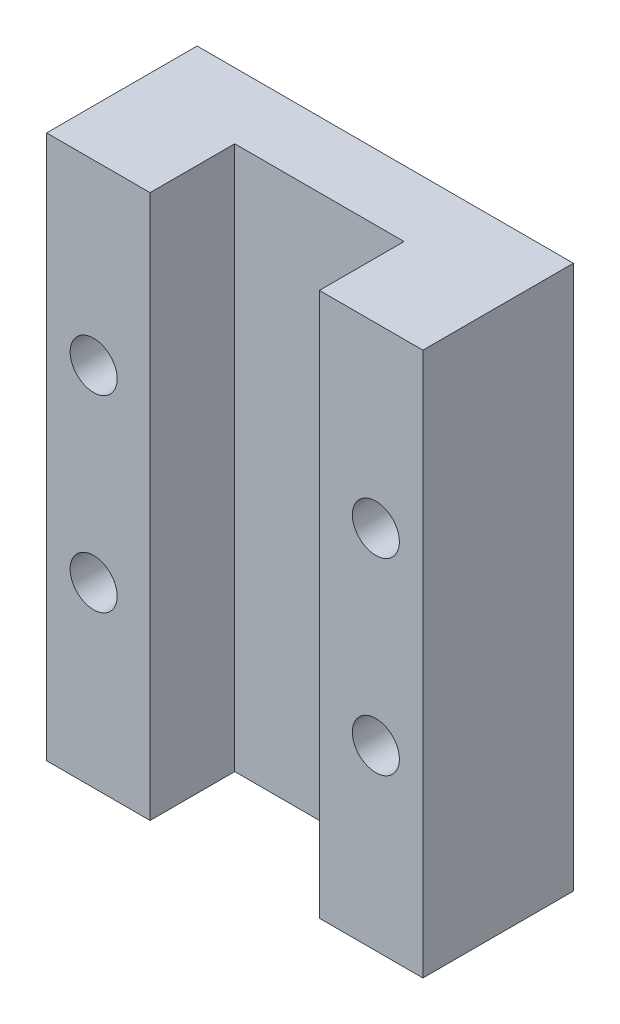
ISO-10303-21;
HEADER;
FILE_DESCRIPTION(('STEP AP214'),'2;1');
FILE_NAME('part.step','',(''),(''),'','','');
FILE_SCHEMA(('AUTOMOTIVE_DESIGN { 1 0 10303 214 1 1 1 1 }'));
ENDSEC;
DATA;
#1=APPLICATION_CONTEXT('core data for automotive mechanical design processes');
#2=APPLICATION_PROTOCOL_DEFINITION('international standard','automotive_design',2000,#1);
#3=PRODUCT_CONTEXT('',#1,'mechanical');
#4=PRODUCT('Part','Part','',(#3));
#5=PRODUCT_RELATED_PRODUCT_CATEGORY('part','',(#4));
#6=PRODUCT_DEFINITION_FORMATION('','',#4);
#7=PRODUCT_DEFINITION_CONTEXT('part definition',#1,'design');
#8=PRODUCT_DEFINITION('design','',#6,#7);
#9=PRODUCT_DEFINITION_SHAPE('','',#8);
#10=(LENGTH_UNIT() NAMED_UNIT(*) SI_UNIT(.MILLI.,.METRE.));
#11=(NAMED_UNIT(*) PLANE_ANGLE_UNIT() SI_UNIT($,.RADIAN.));
#12=(NAMED_UNIT(*) SI_UNIT($,.STERADIAN.) SOLID_ANGLE_UNIT());
#13=UNCERTAINTY_MEASURE_WITH_UNIT(LENGTH_MEASURE(1.E-05),#10,'distance_accuracy_value','');
#14=(GEOMETRIC_REPRESENTATION_CONTEXT(3) GLOBAL_UNCERTAINTY_ASSIGNED_CONTEXT((#13)) GLOBAL_UNIT_ASSIGNED_CONTEXT((#10,
#11,#12)) REPRESENTATION_CONTEXT('',''));
#15=CARTESIAN_POINT('',(0.,0.,0.));
#16=DIRECTION('',(0.,0.,1.));
#17=DIRECTION('',(1.,0.,0.));
#18=AXIS2_PLACEMENT_3D('',#15,#16,#17);
#19=CARTESIAN_POINT('',(0.,0.,8.));
#20=DIRECTION('',(0.,0.,-1.));
#21=DIRECTION('',(-1.,0.,0.));
#22=AXIS2_PLACEMENT_3D('',#19,#20,#21);
#23=PLANE('',#22);
#24=CARTESIAN_POINT('',(2.5,9.45,8.));
#25=DIRECTION('',(0.,0.,-1.));
#26=DIRECTION('',(-1.,0.,0.));
#27=AXIS2_PLACEMENT_3D('',#24,#25,#26);
#28=CIRCLE('',#27,1.25);
#29=CARTESIAN_POINT('',(1.25,9.45,8.));
#30=VERTEX_POINT('',#29);
#31=EDGE_CURVE('E201',#30,#30,#28,.T.);
#32=ORIENTED_EDGE('',*,*,#31,.T.);
#33=EDGE_LOOP('',(#32));
#34=FACE_BOUND('',#33,.T.);
#35=CARTESIAN_POINT('',(2.5,19.45,8.));
#36=DIRECTION('',(0.,0.,-1.));
#37=DIRECTION('',(-1.,0.,0.));
#38=AXIS2_PLACEMENT_3D('',#35,#36,#37);
#39=CIRCLE('',#38,1.25);
#40=CARTESIAN_POINT('',(1.25,19.45,8.));
#41=VERTEX_POINT('',#40);
#42=EDGE_CURVE('E189',#41,#41,#39,.T.);
#43=ORIENTED_EDGE('',*,*,#42,.T.);
#44=EDGE_LOOP('',(#43));
#45=FACE_BOUND('',#44,.T.);
#46=DIRECTION('',(1.,0.,0.));
#47=VECTOR('',#46,1.);
#48=CARTESIAN_POINT('',(0.,0.,8.));
#49=LINE('',#48,#47);
#50=CARTESIAN_POINT('',(0.,0.,8.));
#51=VERTEX_POINT('',#50);
#52=CARTESIAN_POINT('',(5.5,0.,8.));
#53=VERTEX_POINT('',#52);
#54=EDGE_CURVE('E92',#51,#53,#49,.T.);
#55=ORIENTED_EDGE('',*,*,#54,.T.);
#56=DIRECTION('',(0.,1.,0.));
#57=VECTOR('',#56,1.);
#58=CARTESIAN_POINT('',(5.5,0.,8.));
#59=LINE('',#58,#57);
#60=CARTESIAN_POINT('',(5.5,28.9,8.));
#61=VERTEX_POINT('',#60);
#62=EDGE_CURVE('E114',#53,#61,#59,.T.);
#63=ORIENTED_EDGE('',*,*,#62,.T.);
#64=DIRECTION('',(-1.,0.,0.));
#65=VECTOR('',#64,1.);
#66=CARTESIAN_POINT('',(0.,28.9,8.));
#67=LINE('',#66,#65);
#68=CARTESIAN_POINT('',(0.,28.9,8.));
#69=VERTEX_POINT('',#68);
#70=EDGE_CURVE('E63',#61,#69,#67,.T.);
#71=ORIENTED_EDGE('',*,*,#70,.T.);
#72=DIRECTION('',(0.,-1.,0.));
#73=VECTOR('',#72,1.);
#74=CARTESIAN_POINT('',(0.,0.,8.));
#75=LINE('',#74,#73);
#76=EDGE_CURVE('E128',#69,#51,#75,.T.);
#77=ORIENTED_EDGE('',*,*,#76,.T.);
#78=EDGE_LOOP('',(#55,#63,#71,#77));
#79=FACE_BOUND('',#78,.T.);
#80=ADVANCED_FACE('F39',(#34,#45,#79),#23,.F.);
#81=CARTESIAN_POINT('',(0.,0.,8.));
#82=DIRECTION('',(1.,0.,0.));
#83=DIRECTION('',(0.,1.,0.));
#84=AXIS2_PLACEMENT_3D('',#81,#82,#83);
#85=PLANE('',#84);
#86=DIRECTION('',(0.,-1.,0.));
#87=VECTOR('',#86,1.);
#88=CARTESIAN_POINT('',(0.,0.,0.));
#89=LINE('',#88,#87);
#90=CARTESIAN_POINT('',(0.,28.9,0.));
#91=VERTEX_POINT('',#90);
#92=CARTESIAN_POINT('',(0.,0.,0.));
#93=VERTEX_POINT('',#92);
#94=EDGE_CURVE('E140',#91,#93,#89,.T.);
#95=ORIENTED_EDGE('',*,*,#94,.T.);
#96=DIRECTION('',(0.,0.,-1.));
#97=VECTOR('',#96,1.);
#98=CARTESIAN_POINT('',(0.,0.,8.));
#99=LINE('',#98,#97);
#100=EDGE_CURVE('E11',#51,#93,#99,.T.);
#101=ORIENTED_EDGE('',*,*,#100,.F.);
#102=ORIENTED_EDGE('',*,*,#76,.F.);
#103=DIRECTION('',(0.,0.,-1.));
#104=VECTOR('',#103,1.);
#105=CARTESIAN_POINT('',(0.,28.9,8.));
#106=LINE('',#105,#104);
#107=EDGE_CURVE('E139',#69,#91,#106,.T.);
#108=ORIENTED_EDGE('',*,*,#107,.T.);
#109=EDGE_LOOP('',(#95,#101,#102,#108));
#110=FACE_BOUND('',#109,.T.);
#111=ADVANCED_FACE('F41',(#110),#85,.F.);
#112=CARTESIAN_POINT('',(0.,0.,8.));
#113=DIRECTION('',(0.,1.,0.));
#114=DIRECTION('',(0.,0.,1.));
#115=AXIS2_PLACEMENT_3D('',#112,#113,#114);
#116=PLANE('',#115);
#117=DIRECTION('',(-1.,0.,0.));
#118=VECTOR('',#117,1.);
#119=CARTESIAN_POINT('',(5.5,0.,3.5));
#120=LINE('',#119,#118);
#121=CARTESIAN_POINT('',(14.5,0.,3.5));
#122=VERTEX_POINT('',#121);
#123=CARTESIAN_POINT('',(5.5,0.,3.5));
#124=VERTEX_POINT('',#123);
#125=EDGE_CURVE('E121',#122,#124,#120,.T.);
#126=ORIENTED_EDGE('',*,*,#125,.T.);
#127=DIRECTION('',(0.,0.,1.));
#128=VECTOR('',#127,1.);
#129=CARTESIAN_POINT('',(5.5,0.,8.));
#130=LINE('',#129,#128);
#131=EDGE_CURVE('E116',#124,#53,#130,.T.);
#132=ORIENTED_EDGE('',*,*,#131,.T.);
#133=ORIENTED_EDGE('',*,*,#54,.F.);
#134=ORIENTED_EDGE('',*,*,#100,.T.);
#135=DIRECTION('',(1.,0.,0.));
#136=VECTOR('',#135,1.);
#137=CARTESIAN_POINT('',(0.,0.,0.));
#138=LINE('',#137,#136);
#139=CARTESIAN_POINT('',(20.,0.,0.));
#140=VERTEX_POINT('',#139);
#141=EDGE_CURVE('E143',#93,#140,#138,.T.);
#142=ORIENTED_EDGE('',*,*,#141,.T.);
#143=DIRECTION('',(0.,0.,-1.));
#144=VECTOR('',#143,1.);
#145=CARTESIAN_POINT('',(20.,0.,8.));
#146=LINE('',#145,#144);
#147=CARTESIAN_POINT('',(20.,0.,8.));
#148=VERTEX_POINT('',#147);
#149=EDGE_CURVE('E47',#148,#140,#146,.T.);
#150=ORIENTED_EDGE('',*,*,#149,.F.);
#151=CARTESIAN_POINT('',(14.5,0.,8.));
#152=VERTEX_POINT('',#151);
#153=EDGE_CURVE('E131',#152,#148,#49,.T.);
#154=ORIENTED_EDGE('',*,*,#153,.F.);
#155=DIRECTION('',(0.,0.,-1.));
#156=VECTOR('',#155,1.);
#157=CARTESIAN_POINT('',(14.5,0.,8.));
#158=LINE('',#157,#156);
#159=EDGE_CURVE('E54',#152,#122,#158,.T.);
#160=ORIENTED_EDGE('',*,*,#159,.T.);
#161=EDGE_LOOP('',(#126,#132,#133,#134,#142,#150,#154,#160));
#162=FACE_BOUND('',#161,.T.);
#163=ADVANCED_FACE('F123',(#162),#116,.F.);
#164=CARTESIAN_POINT('',(20.,0.,8.));
#165=DIRECTION('',(-1.,0.,0.));
#166=DIRECTION('',(0.,-1.,0.));
#167=AXIS2_PLACEMENT_3D('',#164,#165,#166);
#168=PLANE('',#167);
#169=DIRECTION('',(0.,1.,0.));
#170=VECTOR('',#169,1.);
#171=CARTESIAN_POINT('',(20.,0.,0.));
#172=LINE('',#171,#170);
#173=CARTESIAN_POINT('',(20.,28.9,0.));
#174=VERTEX_POINT('',#173);
#175=EDGE_CURVE('E146',#140,#174,#172,.T.);
#176=ORIENTED_EDGE('',*,*,#175,.T.);
#177=DIRECTION('',(0.,0.,-1.));
#178=VECTOR('',#177,1.);
#179=CARTESIAN_POINT('',(20.,28.9,8.));
#180=LINE('',#179,#178);
#181=CARTESIAN_POINT('',(20.,28.9,8.));
#182=VERTEX_POINT('',#181);
#183=EDGE_CURVE('E150',#182,#174,#180,.T.);
#184=ORIENTED_EDGE('',*,*,#183,.F.);
#185=DIRECTION('',(0.,1.,0.));
#186=VECTOR('',#185,1.);
#187=CARTESIAN_POINT('',(20.,0.,8.));
#188=LINE('',#187,#186);
#189=EDGE_CURVE('E130',#148,#182,#188,.T.);
#190=ORIENTED_EDGE('',*,*,#189,.F.);
#191=ORIENTED_EDGE('',*,*,#149,.T.);
#192=EDGE_LOOP('',(#176,#184,#190,#191));
#193=FACE_BOUND('',#192,.T.);
#194=ADVANCED_FACE('F156',(#193),#168,.F.);
#195=CARTESIAN_POINT('',(0.,28.9,8.));
#196=DIRECTION('',(0.,-1.,0.));
#197=DIRECTION('',(0.,0.,-1.));
#198=AXIS2_PLACEMENT_3D('',#195,#196,#197);
#199=PLANE('',#198);
#200=ORIENTED_EDGE('',*,*,#70,.F.);
#201=DIRECTION('',(0.,0.,1.));
#202=VECTOR('',#201,1.);
#203=CARTESIAN_POINT('',(5.5,28.9,8.));
#204=LINE('',#203,#202);
#205=CARTESIAN_POINT('',(5.5,28.9,3.5));
#206=VERTEX_POINT('',#205);
#207=EDGE_CURVE('E119',#206,#61,#204,.T.);
#208=ORIENTED_EDGE('',*,*,#207,.F.);
#209=DIRECTION('',(-1.,0.,0.));
#210=VECTOR('',#209,1.);
#211=CARTESIAN_POINT('',(5.5,28.9,3.5));
#212=LINE('',#211,#210);
#213=CARTESIAN_POINT('',(14.5,28.9,3.5));
#214=VERTEX_POINT('',#213);
#215=EDGE_CURVE('E125',#214,#206,#212,.T.);
#216=ORIENTED_EDGE('',*,*,#215,.F.);
#217=DIRECTION('',(0.,0.,-1.));
#218=VECTOR('',#217,1.);
#219=CARTESIAN_POINT('',(14.5,28.9,8.));
#220=LINE('',#219,#218);
#221=CARTESIAN_POINT('',(14.5,28.9,8.));
#222=VERTEX_POINT('',#221);
#223=EDGE_CURVE('E167',#222,#214,#220,.T.);
#224=ORIENTED_EDGE('',*,*,#223,.F.);
#225=EDGE_CURVE('E136',#182,#222,#67,.T.);
#226=ORIENTED_EDGE('',*,*,#225,.F.);
#227=ORIENTED_EDGE('',*,*,#183,.T.);
#228=DIRECTION('',(-1.,0.,0.));
#229=VECTOR('',#228,1.);
#230=CARTESIAN_POINT('',(0.,28.9,0.));
#231=LINE('',#230,#229);
#232=EDGE_CURVE('E85',#174,#91,#231,.T.);
#233=ORIENTED_EDGE('',*,*,#232,.T.);
#234=ORIENTED_EDGE('',*,*,#107,.F.);
#235=EDGE_LOOP('',(#200,#208,#216,#224,#226,#227,#233,#234));
#236=FACE_BOUND('',#235,.T.);
#237=ADVANCED_FACE('F163',(#236),#199,.F.);
#238=CARTESIAN_POINT('',(17.5,9.45,8.));
#239=DIRECTION('',(0.,0.,-1.));
#240=DIRECTION('',(-1.,0.,0.));
#241=AXIS2_PLACEMENT_3D('',#238,#239,#240);
#242=CIRCLE('',#241,1.25);
#243=CARTESIAN_POINT('',(16.25,9.45,8.));
#244=VERTEX_POINT('',#243);
#245=EDGE_CURVE('E195',#244,#244,#242,.T.);
#246=ORIENTED_EDGE('',*,*,#245,.T.);
#247=EDGE_LOOP('',(#246));
#248=FACE_BOUND('',#247,.T.);
#249=CARTESIAN_POINT('',(17.5,19.45,8.));
#250=DIRECTION('',(0.,0.,-1.));
#251=DIRECTION('',(-1.,0.,0.));
#252=AXIS2_PLACEMENT_3D('',#249,#250,#251);
#253=CIRCLE('',#252,1.25);
#254=CARTESIAN_POINT('',(16.25,19.45,8.));
#255=VERTEX_POINT('',#254);
#256=EDGE_CURVE('E168',#255,#255,#253,.T.);
#257=ORIENTED_EDGE('',*,*,#256,.T.);
#258=EDGE_LOOP('',(#257));
#259=FACE_BOUND('',#258,.T.);
#260=ORIENTED_EDGE('',*,*,#225,.T.);
#261=DIRECTION('',(0.,1.,0.));
#262=VECTOR('',#261,1.);
#263=CARTESIAN_POINT('',(14.5,0.,8.));
#264=LINE('',#263,#262);
#265=EDGE_CURVE('E120',#152,#222,#264,.T.);
#266=ORIENTED_EDGE('',*,*,#265,.F.);
#267=ORIENTED_EDGE('',*,*,#153,.T.);
#268=ORIENTED_EDGE('',*,*,#189,.T.);
#269=EDGE_LOOP('',(#260,#266,#267,#268));
#270=FACE_BOUND('',#269,.T.);
#271=ADVANCED_FACE('F185',(#248,#259,#270),#23,.F.);
#272=CARTESIAN_POINT('',(0.,0.,0.));
#273=DIRECTION('',(0.,0.,-1.));
#274=DIRECTION('',(-1.,0.,0.));
#275=AXIS2_PLACEMENT_3D('',#272,#273,#274);
#276=PLANE('',#275);
#277=CARTESIAN_POINT('',(2.5,9.45,0.));
#278=DIRECTION('',(0.,0.,-1.));
#279=DIRECTION('',(-1.,0.,0.));
#280=AXIS2_PLACEMENT_3D('',#277,#278,#279);
#281=CIRCLE('',#280,1.25);
#282=CARTESIAN_POINT('',(1.25,9.45,0.));
#283=VERTEX_POINT('',#282);
#284=EDGE_CURVE('E204',#283,#283,#281,.T.);
#285=ORIENTED_EDGE('',*,*,#284,.F.);
#286=EDGE_LOOP('',(#285));
#287=FACE_BOUND('',#286,.T.);
#288=CARTESIAN_POINT('',(17.5,9.45,0.));
#289=DIRECTION('',(0.,0.,-1.));
#290=DIRECTION('',(-1.,0.,0.));
#291=AXIS2_PLACEMENT_3D('',#288,#289,#290);
#292=CIRCLE('',#291,1.25);
#293=CARTESIAN_POINT('',(16.25,9.45,0.));
#294=VERTEX_POINT('',#293);
#295=EDGE_CURVE('E198',#294,#294,#292,.T.);
#296=ORIENTED_EDGE('',*,*,#295,.F.);
#297=EDGE_LOOP('',(#296));
#298=FACE_BOUND('',#297,.T.);
#299=CARTESIAN_POINT('',(2.5,19.45,0.));
#300=DIRECTION('',(0.,0.,-1.));
#301=DIRECTION('',(-1.,0.,0.));
#302=AXIS2_PLACEMENT_3D('',#299,#300,#301);
#303=CIRCLE('',#302,1.25);
#304=CARTESIAN_POINT('',(1.25,19.45,0.));
#305=VERTEX_POINT('',#304);
#306=EDGE_CURVE('E192',#305,#305,#303,.T.);
#307=ORIENTED_EDGE('',*,*,#306,.F.);
#308=EDGE_LOOP('',(#307));
#309=FACE_BOUND('',#308,.T.);
#310=CARTESIAN_POINT('',(17.5,19.45,0.));
#311=DIRECTION('',(0.,0.,-1.));
#312=DIRECTION('',(-1.,0.,0.));
#313=AXIS2_PLACEMENT_3D('',#310,#311,#312);
#314=CIRCLE('',#313,1.25);
#315=CARTESIAN_POINT('',(16.25,19.45,0.));
#316=VERTEX_POINT('',#315);
#317=EDGE_CURVE('E173',#316,#316,#314,.T.);
#318=ORIENTED_EDGE('',*,*,#317,.F.);
#319=EDGE_LOOP('',(#318));
#320=FACE_BOUND('',#319,.T.);
#321=ORIENTED_EDGE('',*,*,#94,.F.);
#322=ORIENTED_EDGE('',*,*,#232,.F.);
#323=ORIENTED_EDGE('',*,*,#175,.F.);
#324=ORIENTED_EDGE('',*,*,#141,.F.);
#325=EDGE_LOOP('',(#321,#322,#323,#324));
#326=FACE_BOUND('',#325,.T.);
#327=ADVANCED_FACE('F161',(#287,#298,#309,#320,#326),#276,.T.);
#328=CARTESIAN_POINT('',(5.5,0.,8.));
#329=DIRECTION('',(-1.,0.,0.));
#330=DIRECTION('',(0.,0.,1.));
#331=AXIS2_PLACEMENT_3D('',#328,#329,#330);
#332=PLANE('',#331);
#333=ORIENTED_EDGE('',*,*,#207,.T.);
#334=ORIENTED_EDGE('',*,*,#62,.F.);
#335=ORIENTED_EDGE('',*,*,#131,.F.);
#336=DIRECTION('',(0.,1.,0.));
#337=VECTOR('',#336,1.);
#338=CARTESIAN_POINT('',(5.5,0.,3.5));
#339=LINE('',#338,#337);
#340=EDGE_CURVE('E144',#124,#206,#339,.T.);
#341=ORIENTED_EDGE('',*,*,#340,.T.);
#342=EDGE_LOOP('',(#333,#334,#335,#341));
#343=FACE_BOUND('',#342,.T.);
#344=ADVANCED_FACE('F115',(#343),#332,.F.);
#345=CARTESIAN_POINT('',(5.5,0.,3.5));
#346=DIRECTION('',(0.,0.,-1.));
#347=DIRECTION('',(-1.,0.,0.));
#348=AXIS2_PLACEMENT_3D('',#345,#346,#347);
#349=PLANE('',#348);
#350=ORIENTED_EDGE('',*,*,#215,.T.);
#351=ORIENTED_EDGE('',*,*,#340,.F.);
#352=ORIENTED_EDGE('',*,*,#125,.F.);
#353=DIRECTION('',(0.,1.,0.));
#354=VECTOR('',#353,1.);
#355=CARTESIAN_POINT('',(14.5,0.,3.5));
#356=LINE('',#355,#354);
#357=EDGE_CURVE('E180',#122,#214,#356,.T.);
#358=ORIENTED_EDGE('',*,*,#357,.T.);
#359=EDGE_LOOP('',(#350,#351,#352,#358));
#360=FACE_BOUND('',#359,.T.);
#361=ADVANCED_FACE('F255',(#360),#349,.F.);
#362=CARTESIAN_POINT('',(14.5,0.,8.));
#363=DIRECTION('',(1.,0.,0.));
#364=DIRECTION('',(0.,0.,-1.));
#365=AXIS2_PLACEMENT_3D('',#362,#363,#364);
#366=PLANE('',#365);
#367=ORIENTED_EDGE('',*,*,#223,.T.);
#368=ORIENTED_EDGE('',*,*,#357,.F.);
#369=ORIENTED_EDGE('',*,*,#159,.F.);
#370=ORIENTED_EDGE('',*,*,#265,.T.);
#371=EDGE_LOOP('',(#367,#368,#369,#370));
#372=FACE_BOUND('',#371,.T.);
#373=ADVANCED_FACE('F182',(#372),#366,.F.);
#374=CARTESIAN_POINT('',(17.5,19.45,0.));
#375=DIRECTION('',(0.,0.,-1.));
#376=DIRECTION('',(-1.,0.,0.));
#377=AXIS2_PLACEMENT_3D('',#374,#375,#376);
#378=CYLINDRICAL_SURFACE('',#377,1.25);
#379=ORIENTED_EDGE('',*,*,#317,.T.);
#380=EDGE_LOOP('',(#379));
#381=FACE_BOUND('',#380,.T.);
#382=ORIENTED_EDGE('',*,*,#256,.F.);
#383=EDGE_LOOP('',(#382));
#384=FACE_BOUND('',#383,.T.);
#385=ADVANCED_FACE('F220',(#381,#384),#378,.F.);
#386=CARTESIAN_POINT('',(2.5,19.45,0.));
#387=DIRECTION('',(0.,0.,-1.));
#388=DIRECTION('',(-1.,0.,0.));
#389=AXIS2_PLACEMENT_3D('',#386,#387,#388);
#390=CYLINDRICAL_SURFACE('',#389,1.25);
#391=ORIENTED_EDGE('',*,*,#306,.T.);
#392=EDGE_LOOP('',(#391));
#393=FACE_BOUND('',#392,.T.);
#394=ORIENTED_EDGE('',*,*,#42,.F.);
#395=EDGE_LOOP('',(#394));
#396=FACE_BOUND('',#395,.T.);
#397=ADVANCED_FACE('F223',(#393,#396),#390,.F.);
#398=CARTESIAN_POINT('',(17.5,9.45,0.));
#399=DIRECTION('',(0.,0.,-1.));
#400=DIRECTION('',(-1.,0.,0.));
#401=AXIS2_PLACEMENT_3D('',#398,#399,#400);
#402=CYLINDRICAL_SURFACE('',#401,1.25);
#403=ORIENTED_EDGE('',*,*,#295,.T.);
#404=EDGE_LOOP('',(#403));
#405=FACE_BOUND('',#404,.T.);
#406=ORIENTED_EDGE('',*,*,#245,.F.);
#407=EDGE_LOOP('',(#406));
#408=FACE_BOUND('',#407,.T.);
#409=ADVANCED_FACE('F245',(#405,#408),#402,.F.);
#410=CARTESIAN_POINT('',(2.5,9.45,0.));
#411=DIRECTION('',(0.,0.,-1.));
#412=DIRECTION('',(-1.,0.,0.));
#413=AXIS2_PLACEMENT_3D('',#410,#411,#412);
#414=CYLINDRICAL_SURFACE('',#413,1.25);
#415=ORIENTED_EDGE('',*,*,#284,.T.);
#416=EDGE_LOOP('',(#415));
#417=FACE_BOUND('',#416,.T.);
#418=ORIENTED_EDGE('',*,*,#31,.F.);
#419=EDGE_LOOP('',(#418));
#420=FACE_BOUND('',#419,.T.);
#421=ADVANCED_FACE('F208',(#417,#420),#414,.F.);
#422=CLOSED_SHELL('',(#80,#111,#163,#194,#237,#271,#327,#344,#361,#373,#385,#397,#409,#421));
#423=MANIFOLD_SOLID_BREP('B2',#422);
#424=ADVANCED_BREP_SHAPE_REPRESENTATION('',(#18,#423),#14);
#425=SHAPE_DEFINITION_REPRESENTATION(#9,#424);
ENDSEC;
END-ISO-10303-21;
